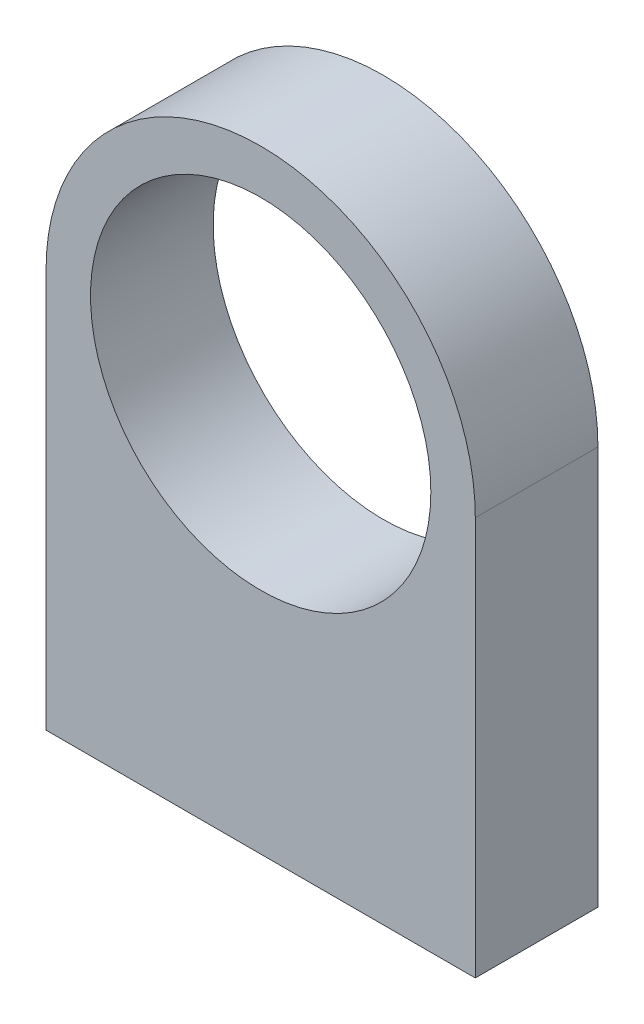
ISO-10303-21;
HEADER;
FILE_DESCRIPTION(('STEP AP214'),'2;1');
FILE_NAME('part.step','',(''),(''),'','','');
FILE_SCHEMA(('AUTOMOTIVE_DESIGN { 1 0 10303 214 1 1 1 1 }'));
ENDSEC;
DATA;
#1=APPLICATION_CONTEXT('core data for automotive mechanical design processes');
#2=APPLICATION_PROTOCOL_DEFINITION('international standard','automotive_design',2000,#1);
#3=PRODUCT_CONTEXT('',#1,'mechanical');
#4=PRODUCT('Part','Part','',(#3));
#5=PRODUCT_RELATED_PRODUCT_CATEGORY('part','',(#4));
#6=PRODUCT_DEFINITION_FORMATION('','',#4);
#7=PRODUCT_DEFINITION_CONTEXT('part definition',#1,'design');
#8=PRODUCT_DEFINITION('design','',#6,#7);
#9=PRODUCT_DEFINITION_SHAPE('','',#8);
#10=(LENGTH_UNIT() NAMED_UNIT(*) SI_UNIT(.MILLI.,.METRE.));
#11=(NAMED_UNIT(*) PLANE_ANGLE_UNIT() SI_UNIT($,.RADIAN.));
#12=(NAMED_UNIT(*) SI_UNIT($,.STERADIAN.) SOLID_ANGLE_UNIT());
#13=UNCERTAINTY_MEASURE_WITH_UNIT(LENGTH_MEASURE(1.E-05),#10,'distance_accuracy_value','');
#14=(GEOMETRIC_REPRESENTATION_CONTEXT(3) GLOBAL_UNCERTAINTY_ASSIGNED_CONTEXT((#13)) GLOBAL_UNIT_ASSIGNED_CONTEXT((#10,
#11,#12)) REPRESENTATION_CONTEXT('',''));
#15=CARTESIAN_POINT('',(0.,0.,0.));
#16=DIRECTION('',(0.,0.,1.));
#17=DIRECTION('',(1.,0.,0.));
#18=AXIS2_PLACEMENT_3D('',#15,#16,#17);
#19=CARTESIAN_POINT('',(0.,0.,8.));
#20=DIRECTION('',(0.,0.,-1.));
#21=DIRECTION('',(-1.,0.,0.));
#22=AXIS2_PLACEMENT_3D('',#19,#20,#21);
#23=PLANE('',#22);
#24=CARTESIAN_POINT('',(0.,0.,8.));
#25=DIRECTION('',(0.,0.,1.));
#26=DIRECTION('',(-1.,0.,0.));
#27=AXIS2_PLACEMENT_3D('',#24,#25,#26);
#28=CIRCLE('',#27,14.);
#29=CARTESIAN_POINT('',(14.,0.,8.));
#30=VERTEX_POINT('',#29);
#31=CARTESIAN_POINT('',(-14.,0.,8.));
#32=VERTEX_POINT('',#31);
#33=EDGE_CURVE('E89',#30,#32,#28,.T.);
#34=ORIENTED_EDGE('',*,*,#33,.T.);
#35=DIRECTION('',(0.,-1.,0.));
#36=VECTOR('',#35,1.);
#37=CARTESIAN_POINT('',(-14.,0.,8.));
#38=LINE('',#37,#36);
#39=CARTESIAN_POINT('',(-14.,-26.,8.));
#40=VERTEX_POINT('',#39);
#41=EDGE_CURVE('E84',#32,#40,#38,.T.);
#42=ORIENTED_EDGE('',*,*,#41,.T.);
#43=DIRECTION('',(1.,0.,0.));
#44=VECTOR('',#43,1.);
#45=CARTESIAN_POINT('',(-14.,-26.,8.));
#46=LINE('',#45,#44);
#47=CARTESIAN_POINT('',(14.,-26.,8.));
#48=VERTEX_POINT('',#47);
#49=EDGE_CURVE('E87',#40,#48,#46,.T.);
#50=ORIENTED_EDGE('',*,*,#49,.T.);
#51=DIRECTION('',(0.,1.,0.));
#52=VECTOR('',#51,1.);
#53=CARTESIAN_POINT('',(14.,0.,8.));
#54=LINE('',#53,#52);
#55=EDGE_CURVE('E54',#48,#30,#54,.T.);
#56=ORIENTED_EDGE('',*,*,#55,.T.);
#57=EDGE_LOOP('',(#34,#42,#50,#56));
#58=FACE_BOUND('',#57,.T.);
#59=CARTESIAN_POINT('',(0.,0.,8.));
#60=DIRECTION('',(0.,0.,1.));
#61=DIRECTION('',(1.,0.,0.));
#62=AXIS2_PLACEMENT_3D('',#59,#60,#61);
#63=CIRCLE('',#62,11.1);
#64=CARTESIAN_POINT('',(11.1,0.,8.));
#65=VERTEX_POINT('',#64);
#66=EDGE_CURVE('E104',#65,#65,#63,.T.);
#67=ORIENTED_EDGE('',*,*,#66,.F.);
#68=EDGE_LOOP('',(#67));
#69=FACE_BOUND('',#68,.T.);
#70=ADVANCED_FACE('F37',(#58,#69),#23,.F.);
#71=CARTESIAN_POINT('',(0.,0.,0.));
#72=DIRECTION('',(0.,0.,-1.));
#73=DIRECTION('',(-1.,0.,0.));
#74=AXIS2_PLACEMENT_3D('',#71,#72,#73);
#75=PLANE('',#74);
#76=CARTESIAN_POINT('',(0.,0.,0.));
#77=DIRECTION('',(0.,0.,1.));
#78=DIRECTION('',(-1.,0.,0.));
#79=AXIS2_PLACEMENT_3D('',#76,#77,#78);
#80=CIRCLE('',#79,14.);
#81=CARTESIAN_POINT('',(14.,0.,0.));
#82=VERTEX_POINT('',#81);
#83=CARTESIAN_POINT('',(-14.,0.,0.));
#84=VERTEX_POINT('',#83);
#85=EDGE_CURVE('E101',#82,#84,#80,.T.);
#86=ORIENTED_EDGE('',*,*,#85,.F.);
#87=DIRECTION('',(0.,1.,0.));
#88=VECTOR('',#87,1.);
#89=CARTESIAN_POINT('',(14.,0.,0.));
#90=LINE('',#89,#88);
#91=CARTESIAN_POINT('',(14.,-26.,0.));
#92=VERTEX_POINT('',#91);
#93=EDGE_CURVE('E77',#92,#82,#90,.T.);
#94=ORIENTED_EDGE('',*,*,#93,.F.);
#95=DIRECTION('',(1.,0.,0.));
#96=VECTOR('',#95,1.);
#97=CARTESIAN_POINT('',(-14.,-26.,0.));
#98=LINE('',#97,#96);
#99=CARTESIAN_POINT('',(-14.,-26.,0.));
#100=VERTEX_POINT('',#99);
#101=EDGE_CURVE('E71',#100,#92,#98,.T.);
#102=ORIENTED_EDGE('',*,*,#101,.F.);
#103=DIRECTION('',(0.,-1.,0.));
#104=VECTOR('',#103,1.);
#105=CARTESIAN_POINT('',(-14.,0.,0.));
#106=LINE('',#105,#104);
#107=EDGE_CURVE('E93',#84,#100,#106,.T.);
#108=ORIENTED_EDGE('',*,*,#107,.F.);
#109=EDGE_LOOP('',(#86,#94,#102,#108));
#110=FACE_BOUND('',#109,.T.);
#111=CARTESIAN_POINT('',(0.,0.,0.));
#112=DIRECTION('',(0.,0.,1.));
#113=DIRECTION('',(1.,0.,0.));
#114=AXIS2_PLACEMENT_3D('',#111,#112,#113);
#115=CIRCLE('',#114,11.1);
#116=CARTESIAN_POINT('',(11.1,0.,0.));
#117=VERTEX_POINT('',#116);
#118=EDGE_CURVE('E116',#117,#117,#115,.T.);
#119=ORIENTED_EDGE('',*,*,#118,.T.);
#120=EDGE_LOOP('',(#119));
#121=FACE_BOUND('',#120,.T.);
#122=ADVANCED_FACE('F112',(#110,#121),#75,.T.);
#123=CARTESIAN_POINT('',(0.,0.,8.));
#124=DIRECTION('',(0.,0.,-1.));
#125=DIRECTION('',(-1.,0.,0.));
#126=AXIS2_PLACEMENT_3D('',#123,#124,#125);
#127=CYLINDRICAL_SURFACE('',#126,14.);
#128=ORIENTED_EDGE('',*,*,#85,.T.);
#129=DIRECTION('',(0.,0.,-1.));
#130=VECTOR('',#129,1.);
#131=CARTESIAN_POINT('',(-14.,0.,8.));
#132=LINE('',#131,#130);
#133=EDGE_CURVE('E11',#32,#84,#132,.T.);
#134=ORIENTED_EDGE('',*,*,#133,.F.);
#135=ORIENTED_EDGE('',*,*,#33,.F.);
#136=DIRECTION('',(0.,0.,-1.));
#137=VECTOR('',#136,1.);
#138=CARTESIAN_POINT('',(14.,0.,8.));
#139=LINE('',#138,#137);
#140=EDGE_CURVE('E97',#30,#82,#139,.T.);
#141=ORIENTED_EDGE('',*,*,#140,.T.);
#142=EDGE_LOOP('',(#128,#134,#135,#141));
#143=FACE_BOUND('',#142,.T.);
#144=ADVANCED_FACE('F39',(#143),#127,.T.);
#145=CARTESIAN_POINT('',(-14.,0.,8.));
#146=DIRECTION('',(1.,0.,0.));
#147=DIRECTION('',(0.,1.,0.));
#148=AXIS2_PLACEMENT_3D('',#145,#146,#147);
#149=PLANE('',#148);
#150=ORIENTED_EDGE('',*,*,#107,.T.);
#151=DIRECTION('',(0.,0.,-1.));
#152=VECTOR('',#151,1.);
#153=CARTESIAN_POINT('',(-14.,-26.,8.));
#154=LINE('',#153,#152);
#155=EDGE_CURVE('E46',#40,#100,#154,.T.);
#156=ORIENTED_EDGE('',*,*,#155,.F.);
#157=ORIENTED_EDGE('',*,*,#41,.F.);
#158=ORIENTED_EDGE('',*,*,#133,.T.);
#159=EDGE_LOOP('',(#150,#156,#157,#158));
#160=FACE_BOUND('',#159,.T.);
#161=ADVANCED_FACE('F92',(#160),#149,.F.);
#162=CARTESIAN_POINT('',(-14.,-26.,8.));
#163=DIRECTION('',(0.,1.,0.));
#164=DIRECTION('',(0.,0.,1.));
#165=AXIS2_PLACEMENT_3D('',#162,#163,#164);
#166=PLANE('',#165);
#167=CARTESIAN_POINT('',(-10.,-26.,4.));
#168=DIRECTION('',(0.,-1.,0.));
#169=DIRECTION('',(0.,0.,-1.));
#170=AXIS2_PLACEMENT_3D('',#167,#168,#169);
#171=CIRCLE('',#170,1.5);
#172=CARTESIAN_POINT('',(-10.,-26.,2.5));
#173=VERTEX_POINT('',#172);
#174=EDGE_CURVE('E128',#173,#173,#171,.T.);
#175=ORIENTED_EDGE('',*,*,#174,.F.);
#176=EDGE_LOOP('',(#175));
#177=FACE_BOUND('',#176,.T.);
#178=CARTESIAN_POINT('',(10.,-26.,4.));
#179=DIRECTION('',(0.,-1.,0.));
#180=DIRECTION('',(0.,0.,-1.));
#181=AXIS2_PLACEMENT_3D('',#178,#179,#180);
#182=CIRCLE('',#181,1.5);
#183=CARTESIAN_POINT('',(10.,-26.,2.5));
#184=VERTEX_POINT('',#183);
#185=EDGE_CURVE('E125',#184,#184,#182,.T.);
#186=ORIENTED_EDGE('',*,*,#185,.F.);
#187=EDGE_LOOP('',(#186));
#188=FACE_BOUND('',#187,.T.);
#189=ORIENTED_EDGE('',*,*,#101,.T.);
#190=DIRECTION('',(0.,0.,-1.));
#191=VECTOR('',#190,1.);
#192=CARTESIAN_POINT('',(14.,-26.,8.));
#193=LINE('',#192,#191);
#194=EDGE_CURVE('E94',#48,#92,#193,.T.);
#195=ORIENTED_EDGE('',*,*,#194,.F.);
#196=ORIENTED_EDGE('',*,*,#49,.F.);
#197=ORIENTED_EDGE('',*,*,#155,.T.);
#198=EDGE_LOOP('',(#189,#195,#196,#197));
#199=FACE_BOUND('',#198,.T.);
#200=ADVANCED_FACE('F95',(#177,#188,#199),#166,.F.);
#201=CARTESIAN_POINT('',(14.,0.,8.));
#202=DIRECTION('',(-1.,0.,0.));
#203=DIRECTION('',(0.,-1.,0.));
#204=AXIS2_PLACEMENT_3D('',#201,#202,#203);
#205=PLANE('',#204);
#206=ORIENTED_EDGE('',*,*,#93,.T.);
#207=ORIENTED_EDGE('',*,*,#140,.F.);
#208=ORIENTED_EDGE('',*,*,#55,.F.);
#209=ORIENTED_EDGE('',*,*,#194,.T.);
#210=EDGE_LOOP('',(#206,#207,#208,#209));
#211=FACE_BOUND('',#210,.T.);
#212=ADVANCED_FACE('F109',(#211),#205,.F.);
#213=CARTESIAN_POINT('',(0.,0.,8.));
#214=DIRECTION('',(0.,0.,-1.));
#215=DIRECTION('',(-1.,0.,0.));
#216=AXIS2_PLACEMENT_3D('',#213,#214,#215);
#217=CYLINDRICAL_SURFACE('',#216,11.1);
#218=ORIENTED_EDGE('',*,*,#66,.T.);
#219=EDGE_LOOP('',(#218));
#220=FACE_BOUND('',#219,.T.);
#221=ORIENTED_EDGE('',*,*,#118,.F.);
#222=EDGE_LOOP('',(#221));
#223=FACE_BOUND('',#222,.T.);
#224=ADVANCED_FACE('F150',(#220,#223),#217,.F.);
#225=CARTESIAN_POINT('',(10.,-11.,4.));
#226=DIRECTION('',(0.,-1.,0.));
#227=DIRECTION('',(0.,0.,-1.));
#228=AXIS2_PLACEMENT_3D('',#225,#226,#227);
#229=CYLINDRICAL_SURFACE('',#228,1.5);
#230=CARTESIAN_POINT('',(10.,-11.,4.));
#231=DIRECTION('',(0.,-1.,0.));
#232=DIRECTION('',(0.,0.,-1.));
#233=AXIS2_PLACEMENT_3D('',#230,#231,#232);
#234=CIRCLE('',#233,1.5);
#235=CARTESIAN_POINT('',(10.,-11.,2.5));
#236=VERTEX_POINT('',#235);
#237=EDGE_CURVE('E122',#236,#236,#234,.T.);
#238=ORIENTED_EDGE('',*,*,#237,.F.);
#239=EDGE_LOOP('',(#238));
#240=FACE_BOUND('',#239,.T.);
#241=ORIENTED_EDGE('',*,*,#185,.T.);
#242=EDGE_LOOP('',(#241));
#243=FACE_BOUND('',#242,.T.);
#244=ADVANCED_FACE('F148',(#240,#243),#229,.F.);
#245=CARTESIAN_POINT('',(10.,-11.,4.));
#246=DIRECTION('',(0.,-1.,0.));
#247=DIRECTION('',(0.,0.,-1.));
#248=AXIS2_PLACEMENT_3D('',#245,#246,#247);
#249=PLANE('',#248);
#250=ORIENTED_EDGE('',*,*,#237,.T.);
#251=EDGE_LOOP('',(#250));
#252=FACE_BOUND('',#251,.T.);
#253=ADVANCED_FACE('F139',(#252),#249,.T.);
#254=CARTESIAN_POINT('',(-10.,-11.,4.));
#255=DIRECTION('',(0.,-1.,0.));
#256=DIRECTION('',(0.,0.,-1.));
#257=AXIS2_PLACEMENT_3D('',#254,#255,#256);
#258=CYLINDRICAL_SURFACE('',#257,1.5);
#259=CARTESIAN_POINT('',(-10.,-11.,4.));
#260=DIRECTION('',(0.,-1.,0.));
#261=DIRECTION('',(0.,0.,-1.));
#262=AXIS2_PLACEMENT_3D('',#259,#260,#261);
#263=CIRCLE('',#262,1.5);
#264=CARTESIAN_POINT('',(-10.,-11.,2.5));
#265=VERTEX_POINT('',#264);
#266=EDGE_CURVE('E119',#265,#265,#263,.T.);
#267=ORIENTED_EDGE('',*,*,#266,.F.);
#268=EDGE_LOOP('',(#267));
#269=FACE_BOUND('',#268,.T.);
#270=ORIENTED_EDGE('',*,*,#174,.T.);
#271=EDGE_LOOP('',(#270));
#272=FACE_BOUND('',#271,.T.);
#273=ADVANCED_FACE('F136',(#269,#272),#258,.F.);
#274=CARTESIAN_POINT('',(-10.,-11.,4.));
#275=DIRECTION('',(0.,-1.,0.));
#276=DIRECTION('',(0.,0.,-1.));
#277=AXIS2_PLACEMENT_3D('',#274,#275,#276);
#278=PLANE('',#277);
#279=ORIENTED_EDGE('',*,*,#266,.T.);
#280=EDGE_LOOP('',(#279));
#281=FACE_BOUND('',#280,.T.);
#282=ADVANCED_FACE('F134',(#281),#278,.T.);
#283=CLOSED_SHELL('',(#70,#122,#144,#161,#200,#212,#224,#244,#253,#273,#282));
#284=MANIFOLD_SOLID_BREP('B2',#283);
#285=ADVANCED_BREP_SHAPE_REPRESENTATION('',(#18,#284),#14);
#286=SHAPE_DEFINITION_REPRESENTATION(#9,#285);
ENDSEC;
END-ISO-10303-21;
